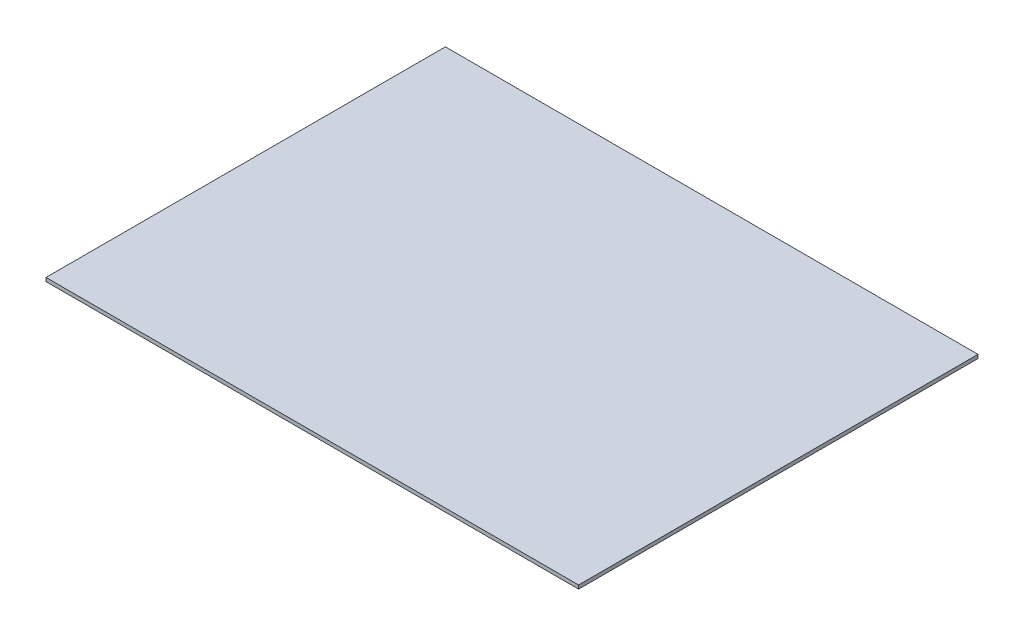
ISO-10303-21;
HEADER;
FILE_DESCRIPTION(('STEP AP214'),'2;1');
FILE_NAME('part.step','',(''),(''),'','','');
FILE_SCHEMA(('AUTOMOTIVE_DESIGN { 1 0 10303 214 1 1 1 1 }'));
ENDSEC;
DATA;
#1=APPLICATION_CONTEXT('core data for automotive mechanical design processes');
#2=APPLICATION_PROTOCOL_DEFINITION('international standard','automotive_design',2000,#1);
#3=PRODUCT_CONTEXT('',#1,'mechanical');
#4=PRODUCT('Part','Part','',(#3));
#5=PRODUCT_RELATED_PRODUCT_CATEGORY('part','',(#4));
#6=PRODUCT_DEFINITION_FORMATION('','',#4);
#7=PRODUCT_DEFINITION_CONTEXT('part definition',#1,'design');
#8=PRODUCT_DEFINITION('design','',#6,#7);
#9=PRODUCT_DEFINITION_SHAPE('','',#8);
#10=(LENGTH_UNIT() NAMED_UNIT(*) SI_UNIT(.MILLI.,.METRE.));
#11=(NAMED_UNIT(*) PLANE_ANGLE_UNIT() SI_UNIT($,.RADIAN.));
#12=(NAMED_UNIT(*) SI_UNIT($,.STERADIAN.) SOLID_ANGLE_UNIT());
#13=UNCERTAINTY_MEASURE_WITH_UNIT(LENGTH_MEASURE(1.E-05),#10,'distance_accuracy_value','');
#14=(GEOMETRIC_REPRESENTATION_CONTEXT(3) GLOBAL_UNCERTAINTY_ASSIGNED_CONTEXT((#13)) GLOBAL_UNIT_ASSIGNED_CONTEXT((#10,
#11,#12)) REPRESENTATION_CONTEXT('',''));
#15=CARTESIAN_POINT('',(0.,0.,0.));
#16=DIRECTION('',(0.,0.,1.));
#17=DIRECTION('',(1.,0.,0.));
#18=AXIS2_PLACEMENT_3D('',#15,#16,#17);
#19=CARTESIAN_POINT('',(199.930020576045,-103.628407062619,-121.727887341027));
#20=DIRECTION('',(1.,0.,0.));
#21=DIRECTION('',(0.,1.,0.));
#22=AXIS2_PLACEMENT_3D('',#19,#20,#21);
#23=PLANE('',#22);
#24=DIRECTION('',(0.,0.,1.));
#25=VECTOR('',#24,1.);
#26=CARTESIAN_POINT('',(199.930020576045,-104.999,-121.727887341027));
#27=LINE('',#26,#25);
#28=CARTESIAN_POINT('',(199.930020576045,-104.999,-121.727887341027));
#29=VERTEX_POINT('',#28);
#30=CARTESIAN_POINT('',(199.930020576045,-104.999,28.132153811062));
#31=VERTEX_POINT('',#30);
#32=EDGE_CURVE('E79',#29,#31,#27,.T.);
#33=ORIENTED_EDGE('',*,*,#32,.F.);
#34=DIRECTION('',(0.,-1.,0.));
#35=VECTOR('',#34,1.);
#36=CARTESIAN_POINT('',(199.930020576045,-103.628407062619,-121.727887341027));
#37=LINE('',#36,#35);
#38=CARTESIAN_POINT('',(199.930020576045,-103.628407062619,-121.727887341027));
#39=VERTEX_POINT('',#38);
#40=EDGE_CURVE('E32',#39,#29,#37,.T.);
#41=ORIENTED_EDGE('',*,*,#40,.F.);
#42=DIRECTION('',(0.,0.,1.));
#43=VECTOR('',#42,1.);
#44=CARTESIAN_POINT('',(199.930020576045,-103.628407062619,-121.727887341027));
#45=LINE('',#44,#43);
#46=CARTESIAN_POINT('',(199.930020576045,-103.628407062619,28.132153811062));
#47=VERTEX_POINT('',#46);
#48=EDGE_CURVE('E71',#39,#47,#45,.T.);
#49=ORIENTED_EDGE('',*,*,#48,.T.);
#50=DIRECTION('',(0.,-1.,0.));
#51=VECTOR('',#50,1.);
#52=CARTESIAN_POINT('',(199.930020576045,-103.628407062619,28.132153811062));
#53=LINE('',#52,#51);
#54=EDGE_CURVE('E10',#47,#31,#53,.T.);
#55=ORIENTED_EDGE('',*,*,#54,.T.);
#56=EDGE_LOOP('',(#33,#41,#49,#55));
#57=FACE_BOUND('',#56,.T.);
#58=ADVANCED_FACE('F16',(#57),#23,.T.);
#59=CARTESIAN_POINT('',(199.930020576045,-103.628407062619,28.132153811062));
#60=DIRECTION('',(0.,0.,1.));
#61=DIRECTION('',(0.,-1.,0.));
#62=AXIS2_PLACEMENT_3D('',#59,#60,#61);
#63=PLANE('',#62);
#64=DIRECTION('',(-1.,0.,0.));
#65=VECTOR('',#64,1.);
#66=CARTESIAN_POINT('',(199.930020576045,-104.999,28.132153811062));
#67=LINE('',#66,#65);
#68=CARTESIAN_POINT('',(0.0699794239554241,-104.999,28.132153811062));
#69=VERTEX_POINT('',#68);
#70=EDGE_CURVE('E82',#31,#69,#67,.T.);
#71=ORIENTED_EDGE('',*,*,#70,.F.);
#72=ORIENTED_EDGE('',*,*,#54,.F.);
#73=DIRECTION('',(-1.,0.,0.));
#74=VECTOR('',#73,1.);
#75=CARTESIAN_POINT('',(199.930020576045,-103.628407062619,28.132153811062));
#76=LINE('',#75,#74);
#77=CARTESIAN_POINT('',(0.0699794239554241,-103.628407062619,28.132153811062));
#78=VERTEX_POINT('',#77);
#79=EDGE_CURVE('E67',#47,#78,#76,.T.);
#80=ORIENTED_EDGE('',*,*,#79,.T.);
#81=DIRECTION('',(0.,-1.,0.));
#82=VECTOR('',#81,1.);
#83=CARTESIAN_POINT('',(0.0699794239554241,-103.628407062619,28.132153811062));
#84=LINE('',#83,#82);
#85=EDGE_CURVE('E24',#78,#69,#84,.T.);
#86=ORIENTED_EDGE('',*,*,#85,.T.);
#87=EDGE_LOOP('',(#71,#72,#80,#86));
#88=FACE_BOUND('',#87,.T.);
#89=ADVANCED_FACE('F68',(#88),#63,.T.);
#90=CARTESIAN_POINT('',(0.0699794239554289,-103.628407062619,28.132153811062));
#91=DIRECTION('',(-1.,0.,0.));
#92=DIRECTION('',(0.,-1.,0.));
#93=AXIS2_PLACEMENT_3D('',#90,#91,#92);
#94=PLANE('',#93);
#95=DIRECTION('',(0.,0.,-1.));
#96=VECTOR('',#95,1.);
#97=CARTESIAN_POINT('',(0.0699794239554289,-104.999,28.132153811062));
#98=LINE('',#97,#96);
#99=CARTESIAN_POINT('',(0.0699794239553825,-104.999,-121.727887341027));
#100=VERTEX_POINT('',#99);
#101=EDGE_CURVE('E65',#69,#100,#98,.T.);
#102=ORIENTED_EDGE('',*,*,#101,.F.);
#103=ORIENTED_EDGE('',*,*,#85,.F.);
#104=DIRECTION('',(0.,0.,-1.));
#105=VECTOR('',#104,1.);
#106=CARTESIAN_POINT('',(0.0699794239554289,-103.628407062619,28.132153811062));
#107=LINE('',#106,#105);
#108=CARTESIAN_POINT('',(0.0699794239553825,-103.628407062619,-121.727887341027));
#109=VERTEX_POINT('',#108);
#110=EDGE_CURVE('E62',#78,#109,#107,.T.);
#111=ORIENTED_EDGE('',*,*,#110,.T.);
#112=DIRECTION('',(0.,-1.,0.));
#113=VECTOR('',#112,1.);
#114=CARTESIAN_POINT('',(0.0699794239553825,-103.628407062619,-121.727887341027));
#115=LINE('',#114,#113);
#116=EDGE_CURVE('E48',#109,#100,#115,.T.);
#117=ORIENTED_EDGE('',*,*,#116,.T.);
#118=EDGE_LOOP('',(#102,#103,#111,#117));
#119=FACE_BOUND('',#118,.T.);
#120=ADVANCED_FACE('F60',(#119),#94,.T.);
#121=CARTESIAN_POINT('',(0.0699794239553825,-103.628407062619,-121.727887341027));
#122=DIRECTION('',(0.,0.,-1.));
#123=DIRECTION('',(0.,1.,0.));
#124=AXIS2_PLACEMENT_3D('',#121,#122,#123);
#125=PLANE('',#124);
#126=DIRECTION('',(1.,0.,0.));
#127=VECTOR('',#126,1.);
#128=CARTESIAN_POINT('',(0.0699794239553825,-104.999,-121.727887341027));
#129=LINE('',#128,#127);
#130=EDGE_CURVE('E85',#100,#29,#129,.T.);
#131=ORIENTED_EDGE('',*,*,#130,.F.);
#132=ORIENTED_EDGE('',*,*,#116,.F.);
#133=DIRECTION('',(1.,0.,0.));
#134=VECTOR('',#133,1.);
#135=CARTESIAN_POINT('',(0.0699794239553825,-103.628407062619,-121.727887341027));
#136=LINE('',#135,#134);
#137=EDGE_CURVE('E74',#109,#39,#136,.T.);
#138=ORIENTED_EDGE('',*,*,#137,.T.);
#139=ORIENTED_EDGE('',*,*,#40,.T.);
#140=EDGE_LOOP('',(#131,#132,#138,#139));
#141=FACE_BOUND('',#140,.T.);
#142=ADVANCED_FACE('F96',(#141),#125,.T.);
#143=CARTESIAN_POINT('',(100.,-103.628407062619,-119.297866764983));
#144=DIRECTION('',(0.,-1.,0.));
#145=DIRECTION('',(1.,0.,0.));
#146=AXIS2_PLACEMENT_3D('',#143,#144,#145);
#147=PLANE('',#146);
#148=ORIENTED_EDGE('',*,*,#48,.F.);
#149=ORIENTED_EDGE('',*,*,#137,.F.);
#150=ORIENTED_EDGE('',*,*,#110,.F.);
#151=ORIENTED_EDGE('',*,*,#79,.F.);
#152=EDGE_LOOP('',(#148,#149,#150,#151));
#153=FACE_BOUND('',#152,.T.);
#154=ADVANCED_FACE('F73',(#153),#147,.F.);
#155=CARTESIAN_POINT('',(100.,-104.999,-119.297866764983));
#156=DIRECTION('',(0.,-1.,0.));
#157=DIRECTION('',(1.,0.,0.));
#158=AXIS2_PLACEMENT_3D('',#155,#156,#157);
#159=PLANE('',#158);
#160=ORIENTED_EDGE('',*,*,#32,.T.);
#161=ORIENTED_EDGE('',*,*,#70,.T.);
#162=ORIENTED_EDGE('',*,*,#101,.T.);
#163=ORIENTED_EDGE('',*,*,#130,.T.);
#164=EDGE_LOOP('',(#160,#161,#162,#163));
#165=FACE_BOUND('',#164,.T.);
#166=ADVANCED_FACE('F89',(#165),#159,.T.);
#167=CLOSED_SHELL('',(#58,#89,#120,#142,#154,#166));
#168=MANIFOLD_SOLID_BREP('B1',#167);
#169=ADVANCED_BREP_SHAPE_REPRESENTATION('',(#18,#168),#14);
#170=SHAPE_DEFINITION_REPRESENTATION(#9,#169);
ENDSEC;
END-ISO-10303-21;
